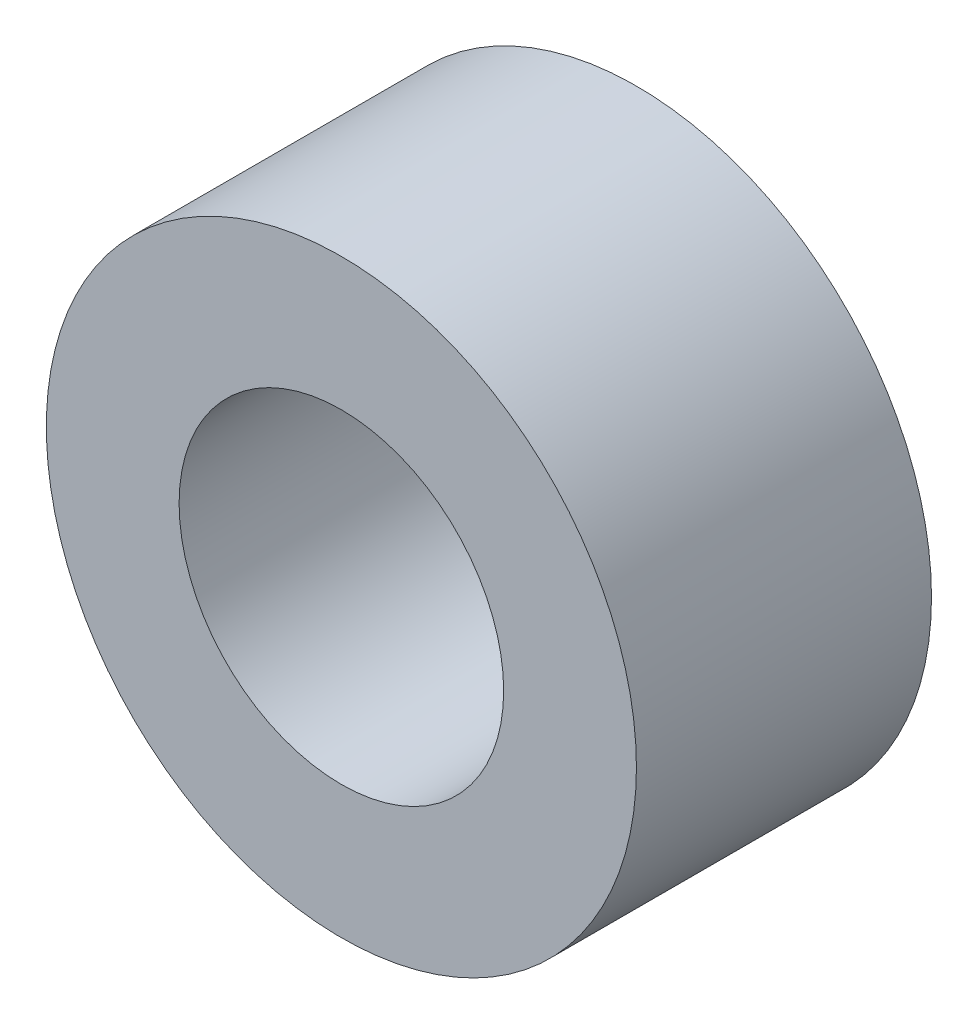
ISO-10303-21;
HEADER;
FILE_DESCRIPTION(('STEP AP214'),'2;1');
FILE_NAME('part.step','',(''),(''),'','','');
FILE_SCHEMA(('AUTOMOTIVE_DESIGN { 1 0 10303 214 1 1 1 1 }'));
ENDSEC;
DATA;
#1=APPLICATION_CONTEXT('core data for automotive mechanical design processes');
#2=APPLICATION_PROTOCOL_DEFINITION('international standard','automotive_design',2000,#1);
#3=PRODUCT_CONTEXT('',#1,'mechanical');
#4=PRODUCT('Part','Part','',(#3));
#5=PRODUCT_RELATED_PRODUCT_CATEGORY('part','',(#4));
#6=PRODUCT_DEFINITION_FORMATION('','',#4);
#7=PRODUCT_DEFINITION_CONTEXT('part definition',#1,'design');
#8=PRODUCT_DEFINITION('design','',#6,#7);
#9=PRODUCT_DEFINITION_SHAPE('','',#8);
#10=(LENGTH_UNIT() NAMED_UNIT(*) SI_UNIT(.MILLI.,.METRE.));
#11=(NAMED_UNIT(*) PLANE_ANGLE_UNIT() SI_UNIT($,.RADIAN.));
#12=(NAMED_UNIT(*) SI_UNIT($,.STERADIAN.) SOLID_ANGLE_UNIT());
#13=UNCERTAINTY_MEASURE_WITH_UNIT(LENGTH_MEASURE(1.E-05),#10,'distance_accuracy_value','');
#14=(GEOMETRIC_REPRESENTATION_CONTEXT(3) GLOBAL_UNCERTAINTY_ASSIGNED_CONTEXT((#13)) GLOBAL_UNIT_ASSIGNED_CONTEXT((#10,
#11,#12)) REPRESENTATION_CONTEXT('',''));
#15=CARTESIAN_POINT('',(0.,0.,0.));
#16=DIRECTION('',(0.,0.,1.));
#17=DIRECTION('',(1.,0.,0.));
#18=AXIS2_PLACEMENT_3D('',#15,#16,#17);
#19=CARTESIAN_POINT('',(0.,0.,2.));
#20=DIRECTION('',(0.,0.,1.));
#21=DIRECTION('',(1.,0.,0.));
#22=AXIS2_PLACEMENT_3D('',#19,#20,#21);
#23=PLANE('',#22);
#24=CARTESIAN_POINT('',(0.,0.,2.));
#25=DIRECTION('',(0.,0.,1.));
#26=DIRECTION('',(1.,0.,0.));
#27=AXIS2_PLACEMENT_3D('',#24,#25,#26);
#28=CIRCLE('',#27,2.);
#29=CARTESIAN_POINT('',(2.,0.,2.));
#30=VERTEX_POINT('',#29);
#31=EDGE_CURVE('E10',#30,#30,#28,.T.);
#32=ORIENTED_EDGE('',*,*,#31,.T.);
#33=EDGE_LOOP('',(#32));
#34=FACE_BOUND('',#33,.T.);
#35=CARTESIAN_POINT('',(0.,0.,2.));
#36=DIRECTION('',(0.,0.,1.));
#37=DIRECTION('',(1.,0.,0.));
#38=AXIS2_PLACEMENT_3D('',#35,#36,#37);
#39=CIRCLE('',#38,1.1);
#40=CARTESIAN_POINT('',(1.1,0.,2.));
#41=VERTEX_POINT('',#40);
#42=EDGE_CURVE('E44',#41,#41,#39,.T.);
#43=ORIENTED_EDGE('',*,*,#42,.F.);
#44=EDGE_LOOP('',(#43));
#45=FACE_BOUND('',#44,.T.);
#46=ADVANCED_FACE('F33',(#34,#45),#23,.T.);
#47=CARTESIAN_POINT('',(0.,0.,0.));
#48=DIRECTION('',(0.,0.,1.));
#49=DIRECTION('',(1.,0.,0.));
#50=AXIS2_PLACEMENT_3D('',#47,#48,#49);
#51=PLANE('',#50);
#52=CARTESIAN_POINT('',(0.,0.,0.));
#53=DIRECTION('',(0.,0.,1.));
#54=DIRECTION('',(1.,0.,0.));
#55=AXIS2_PLACEMENT_3D('',#52,#53,#54);
#56=CIRCLE('',#55,2.);
#57=CARTESIAN_POINT('',(2.,0.,0.));
#58=VERTEX_POINT('',#57);
#59=EDGE_CURVE('E37',#58,#58,#56,.T.);
#60=ORIENTED_EDGE('',*,*,#59,.F.);
#61=EDGE_LOOP('',(#60));
#62=FACE_BOUND('',#61,.T.);
#63=CARTESIAN_POINT('',(0.,0.,0.));
#64=DIRECTION('',(0.,0.,1.));
#65=DIRECTION('',(1.,0.,0.));
#66=AXIS2_PLACEMENT_3D('',#63,#64,#65);
#67=CIRCLE('',#66,1.1);
#68=CARTESIAN_POINT('',(1.1,0.,0.));
#69=VERTEX_POINT('',#68);
#70=EDGE_CURVE('E46',#69,#69,#67,.T.);
#71=ORIENTED_EDGE('',*,*,#70,.T.);
#72=EDGE_LOOP('',(#71));
#73=FACE_BOUND('',#72,.T.);
#74=ADVANCED_FACE('F56',(#62,#73),#51,.F.);
#75=CARTESIAN_POINT('',(0.,0.,2.));
#76=DIRECTION('',(0.,0.,-1.));
#77=DIRECTION('',(-1.,0.,0.));
#78=AXIS2_PLACEMENT_3D('',#75,#76,#77);
#79=CYLINDRICAL_SURFACE('',#78,2.);
#80=ORIENTED_EDGE('',*,*,#31,.F.);
#81=EDGE_LOOP('',(#80));
#82=FACE_BOUND('',#81,.T.);
#83=ORIENTED_EDGE('',*,*,#59,.T.);
#84=EDGE_LOOP('',(#83));
#85=FACE_BOUND('',#84,.T.);
#86=ADVANCED_FACE('F35',(#82,#85),#79,.T.);
#87=CARTESIAN_POINT('',(0.,0.,2.));
#88=DIRECTION('',(0.,0.,-1.));
#89=DIRECTION('',(-1.,0.,0.));
#90=AXIS2_PLACEMENT_3D('',#87,#88,#89);
#91=CYLINDRICAL_SURFACE('',#90,1.1);
#92=ORIENTED_EDGE('',*,*,#42,.T.);
#93=EDGE_LOOP('',(#92));
#94=FACE_BOUND('',#93,.T.);
#95=ORIENTED_EDGE('',*,*,#70,.F.);
#96=EDGE_LOOP('',(#95));
#97=FACE_BOUND('',#96,.T.);
#98=ADVANCED_FACE('F52',(#94,#97),#91,.F.);
#99=CLOSED_SHELL('',(#46,#74,#86,#98));
#100=MANIFOLD_SOLID_BREP('B2',#99);
#101=ADVANCED_BREP_SHAPE_REPRESENTATION('',(#18,#100),#14);
#102=SHAPE_DEFINITION_REPRESENTATION(#9,#101);
ENDSEC;
END-ISO-10303-21;
